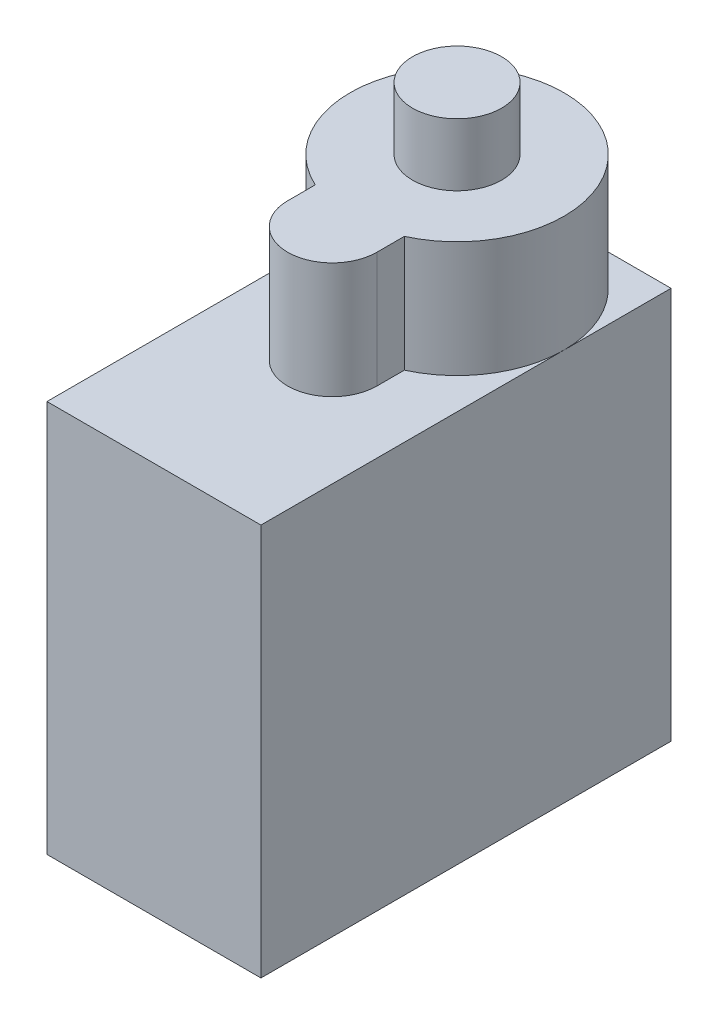
ISO-10303-21;
HEADER;
FILE_DESCRIPTION(('STEP AP214'),'2;1');
FILE_NAME('part.step','',(''),(''),'','','');
FILE_SCHEMA(('AUTOMOTIVE_DESIGN { 1 0 10303 214 1 1 1 1 }'));
ENDSEC;
DATA;
#1=APPLICATION_CONTEXT('core data for automotive mechanical design processes');
#2=APPLICATION_PROTOCOL_DEFINITION('international standard','automotive_design',2000,#1);
#3=PRODUCT_CONTEXT('',#1,'mechanical');
#4=PRODUCT('Part','Part','',(#3));
#5=PRODUCT_RELATED_PRODUCT_CATEGORY('part','',(#4));
#6=PRODUCT_DEFINITION_FORMATION('','',#4);
#7=PRODUCT_DEFINITION_CONTEXT('part definition',#1,'design');
#8=PRODUCT_DEFINITION('design','',#6,#7);
#9=PRODUCT_DEFINITION_SHAPE('','',#8);
#10=(LENGTH_UNIT() NAMED_UNIT(*) SI_UNIT(.MILLI.,.METRE.));
#11=(NAMED_UNIT(*) PLANE_ANGLE_UNIT() SI_UNIT($,.RADIAN.));
#12=(NAMED_UNIT(*) SI_UNIT($,.STERADIAN.) SOLID_ANGLE_UNIT());
#13=UNCERTAINTY_MEASURE_WITH_UNIT(LENGTH_MEASURE(1.E-05),#10,'distance_accuracy_value','');
#14=(GEOMETRIC_REPRESENTATION_CONTEXT(3) GLOBAL_UNCERTAINTY_ASSIGNED_CONTEXT((#13)) GLOBAL_UNIT_ASSIGNED_CONTEXT((#10,
#11,#12)) REPRESENTATION_CONTEXT('',''));
#15=CARTESIAN_POINT('',(0.,0.,0.));
#16=DIRECTION('',(0.,0.,1.));
#17=DIRECTION('',(1.,0.,0.));
#18=AXIS2_PLACEMENT_3D('',#15,#16,#17);
#19=CARTESIAN_POINT('',(51.3143674534142,32.,99.1515964372952));
#20=DIRECTION('',(0.,-1.,0.));
#21=DIRECTION('',(0.,0.,-1.));
#22=AXIS2_PLACEMENT_3D('',#19,#20,#21);
#23=CYLINDRICAL_SURFACE('',#22,2.5);
#24=CARTESIAN_POINT('',(51.3143674534142,28.5,99.1515964372952));
#25=DIRECTION('',(0.,1.,0.));
#26=DIRECTION('',(0.,0.,1.));
#27=AXIS2_PLACEMENT_3D('',#24,#25,#26);
#28=CIRCLE('',#27,2.5);
#29=CARTESIAN_POINT('',(51.3143674534142,28.5,101.651596437295));
#30=VERTEX_POINT('',#29);
#31=EDGE_CURVE('E164',#30,#30,#28,.T.);
#32=ORIENTED_EDGE('',*,*,#31,.T.);
#33=EDGE_LOOP('',(#32));
#34=FACE_BOUND('',#33,.T.);
#35=CARTESIAN_POINT('',(51.3143674534142,32.,99.1515964372952));
#36=DIRECTION('',(0.,1.,0.));
#37=DIRECTION('',(0.,0.,1.));
#38=AXIS2_PLACEMENT_3D('',#35,#36,#37);
#39=CIRCLE('',#38,2.5);
#40=CARTESIAN_POINT('',(51.3143674534142,32.,101.651596437295));
#41=VERTEX_POINT('',#40);
#42=EDGE_CURVE('E39',#41,#41,#39,.T.);
#43=ORIENTED_EDGE('',*,*,#42,.F.);
#44=EDGE_LOOP('',(#43));
#45=FACE_BOUND('',#44,.T.);
#46=ADVANCED_FACE('F32',(#34,#45),#23,.T.);
#47=CARTESIAN_POINT('',(51.3143674534142,32.,99.1515964372952));
#48=DIRECTION('',(0.,1.,0.));
#49=DIRECTION('',(0.,0.,1.));
#50=AXIS2_PLACEMENT_3D('',#47,#48,#49);
#51=PLANE('',#50);
#52=ORIENTED_EDGE('',*,*,#42,.T.);
#53=EDGE_LOOP('',(#52));
#54=FACE_BOUND('',#53,.T.);
#55=ADVANCED_FACE('F228',(#54),#51,.T.);
#56=CARTESIAN_POINT('',(51.3143674534142,28.5,99.1515964372952));
#57=DIRECTION('',(0.,-1.,0.));
#58=DIRECTION('',(0.,0.,-1.));
#59=AXIS2_PLACEMENT_3D('',#56,#57,#58);
#60=CYLINDRICAL_SURFACE('',#59,6.);
#61=CARTESIAN_POINT('',(51.3143674534142,22.,99.1515964372952));
#62=DIRECTION('',(0.,1.,0.));
#63=DIRECTION('',(0.,0.,1.));
#64=AXIS2_PLACEMENT_3D('',#61,#62,#63);
#65=CIRCLE('',#64,6.);
#66=CARTESIAN_POINT('',(57.3143674534142,22.,99.1515964372952));
#67=VERTEX_POINT('',#66);
#68=CARTESIAN_POINT('',(51.3143674534142,22.,93.1515964372952));
#69=VERTEX_POINT('',#68);
#70=EDGE_CURVE('E144',#67,#69,#65,.T.);
#71=ORIENTED_EDGE('',*,*,#70,.T.);
#72=CARTESIAN_POINT('',(45.3143674534142,22.,99.1515964372952));
#73=VERTEX_POINT('',#72);
#74=EDGE_CURVE('E190',#69,#73,#65,.T.);
#75=ORIENTED_EDGE('',*,*,#74,.T.);
#76=CARTESIAN_POINT('',(48.8143674534142,22.,104.605952494613));
#77=VERTEX_POINT('',#76);
#78=EDGE_CURVE('E110',#73,#77,#65,.T.);
#79=ORIENTED_EDGE('',*,*,#78,.T.);
#80=DIRECTION('',(0.,-1.,0.));
#81=VECTOR('',#80,1.);
#82=CARTESIAN_POINT('',(48.8143674534142,28.5,104.605952494613));
#83=LINE('',#82,#81);
#84=CARTESIAN_POINT('',(48.8143674534142,28.5,104.605952494613));
#85=VERTEX_POINT('',#84);
#86=EDGE_CURVE('E161',#85,#77,#83,.T.);
#87=ORIENTED_EDGE('',*,*,#86,.F.);
#88=CARTESIAN_POINT('',(51.3143674534142,28.5,99.1515964372952));
#89=DIRECTION('',(0.,1.,0.));
#90=DIRECTION('',(0.,0.,1.));
#91=AXIS2_PLACEMENT_3D('',#88,#89,#90);
#92=CIRCLE('',#91,6.);
#93=CARTESIAN_POINT('',(53.8143674534142,28.5,104.605952494613));
#94=VERTEX_POINT('',#93);
#95=EDGE_CURVE('E145',#94,#85,#92,.T.);
#96=ORIENTED_EDGE('',*,*,#95,.F.);
#97=DIRECTION('',(0.,-1.,0.));
#98=VECTOR('',#97,1.);
#99=CARTESIAN_POINT('',(53.8143674534142,28.5,104.605952494613));
#100=LINE('',#99,#98);
#101=CARTESIAN_POINT('',(53.8143674534142,22.,104.605952494613));
#102=VERTEX_POINT('',#101);
#103=EDGE_CURVE('E152',#94,#102,#100,.T.);
#104=ORIENTED_EDGE('',*,*,#103,.T.);
#105=EDGE_CURVE('E46',#102,#67,#65,.T.);
#106=ORIENTED_EDGE('',*,*,#105,.T.);
#107=EDGE_LOOP('',(#71,#75,#79,#87,#96,#104,#106));
#108=FACE_BOUND('',#107,.T.);
#109=ADVANCED_FACE('F181',(#108),#60,.T.);
#110=CARTESIAN_POINT('',(48.8143674534142,28.5,106.151596437295));
#111=DIRECTION('',(1.,0.,0.));
#112=DIRECTION('',(0.,0.,-1.));
#113=AXIS2_PLACEMENT_3D('',#110,#111,#112);
#114=PLANE('',#113);
#115=ORIENTED_EDGE('',*,*,#86,.T.);
#116=DIRECTION('',(0.,0.,1.));
#117=VECTOR('',#116,1.);
#118=CARTESIAN_POINT('',(48.8143674534142,22.,106.151596437295));
#119=LINE('',#118,#117);
#120=CARTESIAN_POINT('',(48.8143674534142,22.,106.151596437295));
#121=VERTEX_POINT('',#120);
#122=EDGE_CURVE('E135',#77,#121,#119,.T.);
#123=ORIENTED_EDGE('',*,*,#122,.T.);
#124=DIRECTION('',(0.,-1.,0.));
#125=VECTOR('',#124,1.);
#126=CARTESIAN_POINT('',(48.8143674534142,28.5,106.151596437295));
#127=LINE('',#126,#125);
#128=CARTESIAN_POINT('',(48.8143674534142,28.5,106.151596437295));
#129=VERTEX_POINT('',#128);
#130=EDGE_CURVE('E158',#129,#121,#127,.T.);
#131=ORIENTED_EDGE('',*,*,#130,.F.);
#132=DIRECTION('',(0.,0.,1.));
#133=VECTOR('',#132,1.);
#134=CARTESIAN_POINT('',(48.8143674534142,28.5,106.151596437295));
#135=LINE('',#134,#133);
#136=EDGE_CURVE('E147',#85,#129,#135,.T.);
#137=ORIENTED_EDGE('',*,*,#136,.F.);
#138=EDGE_LOOP('',(#115,#123,#131,#137));
#139=FACE_BOUND('',#138,.T.);
#140=ADVANCED_FACE('F184',(#139),#114,.F.);
#141=CARTESIAN_POINT('',(51.3143674534142,28.5,106.151596437295));
#142=DIRECTION('',(0.,-1.,0.));
#143=DIRECTION('',(0.,0.,-1.));
#144=AXIS2_PLACEMENT_3D('',#141,#142,#143);
#145=CYLINDRICAL_SURFACE('',#144,2.5);
#146=ORIENTED_EDGE('',*,*,#130,.T.);
#147=CARTESIAN_POINT('',(51.3143674534142,22.,106.151596437295));
#148=DIRECTION('',(0.,1.,0.));
#149=DIRECTION('',(0.,0.,1.));
#150=AXIS2_PLACEMENT_3D('',#147,#148,#149);
#151=CIRCLE('',#150,2.5);
#152=CARTESIAN_POINT('',(53.8143674534142,22.,106.151596437295));
#153=VERTEX_POINT('',#152);
#154=EDGE_CURVE('E132',#121,#153,#151,.T.);
#155=ORIENTED_EDGE('',*,*,#154,.T.);
#156=DIRECTION('',(0.,-1.,0.));
#157=VECTOR('',#156,1.);
#158=CARTESIAN_POINT('',(53.8143674534142,28.5,106.151596437295));
#159=LINE('',#158,#157);
#160=CARTESIAN_POINT('',(53.8143674534142,28.5,106.151596437295));
#161=VERTEX_POINT('',#160);
#162=EDGE_CURVE('E155',#161,#153,#159,.T.);
#163=ORIENTED_EDGE('',*,*,#162,.F.);
#164=CARTESIAN_POINT('',(51.3143674534142,28.5,106.151596437295));
#165=DIRECTION('',(0.,1.,0.));
#166=DIRECTION('',(0.,0.,1.));
#167=AXIS2_PLACEMENT_3D('',#164,#165,#166);
#168=CIRCLE('',#167,2.5);
#169=EDGE_CURVE('E149',#129,#161,#168,.T.);
#170=ORIENTED_EDGE('',*,*,#169,.F.);
#171=EDGE_LOOP('',(#146,#155,#163,#170));
#172=FACE_BOUND('',#171,.T.);
#173=ADVANCED_FACE('F188',(#172),#145,.T.);
#174=CARTESIAN_POINT('',(53.8143674534142,28.5,104.605952494613));
#175=DIRECTION('',(-1.,0.,0.));
#176=DIRECTION('',(0.,0.,1.));
#177=AXIS2_PLACEMENT_3D('',#174,#175,#176);
#178=PLANE('',#177);
#179=ORIENTED_EDGE('',*,*,#162,.T.);
#180=DIRECTION('',(0.,0.,-1.));
#181=VECTOR('',#180,1.);
#182=CARTESIAN_POINT('',(53.8143674534142,22.,104.605952494613));
#183=LINE('',#182,#181);
#184=EDGE_CURVE('E11',#153,#102,#183,.T.);
#185=ORIENTED_EDGE('',*,*,#184,.T.);
#186=ORIENTED_EDGE('',*,*,#103,.F.);
#187=DIRECTION('',(0.,0.,-1.));
#188=VECTOR('',#187,1.);
#189=CARTESIAN_POINT('',(53.8143674534142,28.5,104.605952494613));
#190=LINE('',#189,#188);
#191=EDGE_CURVE('E53',#161,#94,#190,.T.);
#192=ORIENTED_EDGE('',*,*,#191,.F.);
#193=EDGE_LOOP('',(#179,#185,#186,#192));
#194=FACE_BOUND('',#193,.T.);
#195=ADVANCED_FACE('F174',(#194),#178,.F.);
#196=CARTESIAN_POINT('',(51.3143674534142,28.5,99.1515964372952));
#197=DIRECTION('',(0.,1.,0.));
#198=DIRECTION('',(0.,0.,1.));
#199=AXIS2_PLACEMENT_3D('',#196,#197,#198);
#200=PLANE('',#199);
#201=ORIENTED_EDGE('',*,*,#31,.F.);
#202=EDGE_LOOP('',(#201));
#203=FACE_BOUND('',#202,.T.);
#204=ORIENTED_EDGE('',*,*,#95,.T.);
#205=ORIENTED_EDGE('',*,*,#136,.T.);
#206=ORIENTED_EDGE('',*,*,#169,.T.);
#207=ORIENTED_EDGE('',*,*,#191,.T.);
#208=EDGE_LOOP('',(#204,#205,#206,#207));
#209=FACE_BOUND('',#208,.T.);
#210=ADVANCED_FACE('F171',(#203,#209),#200,.T.);
#211=CARTESIAN_POINT('',(0.,22.,0.));
#212=DIRECTION('',(0.,1.,0.));
#213=DIRECTION('',(0.,0.,1.));
#214=AXIS2_PLACEMENT_3D('',#211,#212,#213);
#215=PLANE('',#214);
#216=ORIENTED_EDGE('',*,*,#70,.F.);
#217=DIRECTION('',(0.,0.,-1.));
#218=VECTOR('',#217,1.);
#219=CARTESIAN_POINT('',(57.3143674534142,22.,93.1515964372952));
#220=LINE('',#219,#218);
#221=CARTESIAN_POINT('',(57.3143674534142,22.,93.1515964372952));
#222=VERTEX_POINT('',#221);
#223=EDGE_CURVE('E126',#67,#222,#220,.T.);
#224=ORIENTED_EDGE('',*,*,#223,.T.);
#225=DIRECTION('',(-1.,0.,0.));
#226=VECTOR('',#225,1.);
#227=CARTESIAN_POINT('',(45.3143674534142,22.,93.1515964372952));
#228=LINE('',#227,#226);
#229=EDGE_CURVE('E196',#222,#69,#228,.T.);
#230=ORIENTED_EDGE('',*,*,#229,.T.);
#231=EDGE_LOOP('',(#216,#224,#230));
#232=FACE_BOUND('',#231,.T.);
#233=ADVANCED_FACE('F173',(#232),#215,.T.);
#234=ORIENTED_EDGE('',*,*,#74,.F.);
#235=CARTESIAN_POINT('',(45.3143674534142,22.,93.1515964372952));
#236=VERTEX_POINT('',#235);
#237=EDGE_CURVE('E203',#69,#236,#228,.T.);
#238=ORIENTED_EDGE('',*,*,#237,.T.);
#239=DIRECTION('',(0.,0.,1.));
#240=VECTOR('',#239,1.);
#241=CARTESIAN_POINT('',(45.3143674534142,22.,93.1515964372952));
#242=LINE('',#241,#240);
#243=EDGE_CURVE('E115',#236,#73,#242,.T.);
#244=ORIENTED_EDGE('',*,*,#243,.T.);
#245=EDGE_LOOP('',(#234,#238,#244));
#246=FACE_BOUND('',#245,.T.);
#247=ADVANCED_FACE('F219',(#246),#215,.T.);
#248=ORIENTED_EDGE('',*,*,#78,.F.);
#249=CARTESIAN_POINT('',(45.3143674534142,22.,116.151596437295));
#250=VERTEX_POINT('',#249);
#251=EDGE_CURVE('E104',#73,#250,#242,.T.);
#252=ORIENTED_EDGE('',*,*,#251,.T.);
#253=DIRECTION('',(1.,0.,0.));
#254=VECTOR('',#253,1.);
#255=CARTESIAN_POINT('',(45.3143674534142,22.,116.151596437295));
#256=LINE('',#255,#254);
#257=CARTESIAN_POINT('',(57.3143674534142,22.,116.151596437295));
#258=VERTEX_POINT('',#257);
#259=EDGE_CURVE('E107',#250,#258,#256,.T.);
#260=ORIENTED_EDGE('',*,*,#259,.T.);
#261=EDGE_CURVE('E199',#258,#67,#220,.T.);
#262=ORIENTED_EDGE('',*,*,#261,.T.);
#263=ORIENTED_EDGE('',*,*,#105,.F.);
#264=ORIENTED_EDGE('',*,*,#184,.F.);
#265=ORIENTED_EDGE('',*,*,#154,.F.);
#266=ORIENTED_EDGE('',*,*,#122,.F.);
#267=EDGE_LOOP('',(#248,#252,#260,#262,#263,#264,#265,#266));
#268=FACE_BOUND('',#267,.T.);
#269=ADVANCED_FACE('F106',(#268),#215,.T.);
#270=CARTESIAN_POINT('',(45.3143674534142,22.,93.1515964372952));
#271=DIRECTION('',(1.,0.,0.));
#272=DIRECTION('',(0.,0.,-1.));
#273=AXIS2_PLACEMENT_3D('',#270,#271,#272);
#274=PLANE('',#273);
#275=ORIENTED_EDGE('',*,*,#251,.F.);
#276=ORIENTED_EDGE('',*,*,#243,.F.);
#277=DIRECTION('',(0.,-1.,0.));
#278=VECTOR('',#277,1.);
#279=CARTESIAN_POINT('',(45.3143674534142,22.,93.1515964372952));
#280=LINE('',#279,#278);
#281=CARTESIAN_POINT('',(45.3143674534142,0.,93.1515964372952));
#282=VERTEX_POINT('',#281);
#283=EDGE_CURVE('E206',#236,#282,#280,.T.);
#284=ORIENTED_EDGE('',*,*,#283,.T.);
#285=DIRECTION('',(0.,0.,1.));
#286=VECTOR('',#285,1.);
#287=CARTESIAN_POINT('',(45.3143674534142,0.,93.1515964372952));
#288=LINE('',#287,#286);
#289=CARTESIAN_POINT('',(45.3143674534142,0.,116.151596437295));
#290=VERTEX_POINT('',#289);
#291=EDGE_CURVE('E130',#282,#290,#288,.T.);
#292=ORIENTED_EDGE('',*,*,#291,.T.);
#293=DIRECTION('',(0.,-1.,0.));
#294=VECTOR('',#293,1.);
#295=CARTESIAN_POINT('',(45.3143674534142,22.,116.151596437295));
#296=LINE('',#295,#294);
#297=EDGE_CURVE('E122',#250,#290,#296,.T.);
#298=ORIENTED_EDGE('',*,*,#297,.F.);
#299=EDGE_LOOP('',(#275,#276,#284,#292,#298));
#300=FACE_BOUND('',#299,.T.);
#301=ADVANCED_FACE('F128',(#300),#274,.F.);
#302=CARTESIAN_POINT('',(57.3143674534142,22.,93.1515964372952));
#303=DIRECTION('',(-1.,0.,0.));
#304=DIRECTION('',(0.,0.,1.));
#305=AXIS2_PLACEMENT_3D('',#302,#303,#304);
#306=PLANE('',#305);
#307=ORIENTED_EDGE('',*,*,#223,.F.);
#308=ORIENTED_EDGE('',*,*,#261,.F.);
#309=DIRECTION('',(0.,-1.,0.));
#310=VECTOR('',#309,1.);
#311=CARTESIAN_POINT('',(57.3143674534142,22.,116.151596437295));
#312=LINE('',#311,#310);
#313=CARTESIAN_POINT('',(57.3143674534142,0.,116.151596437295));
#314=VERTEX_POINT('',#313);
#315=EDGE_CURVE('E124',#258,#314,#312,.T.);
#316=ORIENTED_EDGE('',*,*,#315,.T.);
#317=DIRECTION('',(0.,0.,-1.));
#318=VECTOR('',#317,1.);
#319=CARTESIAN_POINT('',(57.3143674534142,0.,93.1515964372952));
#320=LINE('',#319,#318);
#321=CARTESIAN_POINT('',(57.3143674534142,0.,93.1515964372952));
#322=VERTEX_POINT('',#321);
#323=EDGE_CURVE('E210',#314,#322,#320,.T.);
#324=ORIENTED_EDGE('',*,*,#323,.T.);
#325=DIRECTION('',(0.,-1.,0.));
#326=VECTOR('',#325,1.);
#327=CARTESIAN_POINT('',(57.3143674534142,22.,93.1515964372952));
#328=LINE('',#327,#326);
#329=EDGE_CURVE('E137',#222,#322,#328,.T.);
#330=ORIENTED_EDGE('',*,*,#329,.F.);
#331=EDGE_LOOP('',(#307,#308,#316,#324,#330));
#332=FACE_BOUND('',#331,.T.);
#333=ADVANCED_FACE('F198',(#332),#306,.F.);
#334=CARTESIAN_POINT('',(45.3143674534142,22.,93.1515964372952));
#335=DIRECTION('',(0.,0.,1.));
#336=DIRECTION('',(1.,0.,0.));
#337=AXIS2_PLACEMENT_3D('',#334,#335,#336);
#338=PLANE('',#337);
#339=ORIENTED_EDGE('',*,*,#237,.F.);
#340=ORIENTED_EDGE('',*,*,#229,.F.);
#341=ORIENTED_EDGE('',*,*,#329,.T.);
#342=DIRECTION('',(-1.,0.,0.));
#343=VECTOR('',#342,1.);
#344=CARTESIAN_POINT('',(45.3143674534142,0.,93.1515964372952));
#345=LINE('',#344,#343);
#346=EDGE_CURVE('E116',#322,#282,#345,.T.);
#347=ORIENTED_EDGE('',*,*,#346,.T.);
#348=ORIENTED_EDGE('',*,*,#283,.F.);
#349=EDGE_LOOP('',(#339,#340,#341,#347,#348));
#350=FACE_BOUND('',#349,.T.);
#351=ADVANCED_FACE('F216',(#350),#338,.F.);
#352=CARTESIAN_POINT('',(45.3143674534142,22.,116.151596437295));
#353=DIRECTION('',(0.,0.,-1.));
#354=DIRECTION('',(-1.,0.,0.));
#355=AXIS2_PLACEMENT_3D('',#352,#353,#354);
#356=PLANE('',#355);
#357=DIRECTION('',(1.,0.,0.));
#358=VECTOR('',#357,1.);
#359=CARTESIAN_POINT('',(45.3143674534142,0.,116.151596437295));
#360=LINE('',#359,#358);
#361=EDGE_CURVE('E208',#290,#314,#360,.T.);
#362=ORIENTED_EDGE('',*,*,#361,.T.);
#363=ORIENTED_EDGE('',*,*,#315,.F.);
#364=ORIENTED_EDGE('',*,*,#259,.F.);
#365=ORIENTED_EDGE('',*,*,#297,.T.);
#366=EDGE_LOOP('',(#362,#363,#364,#365));
#367=FACE_BOUND('',#366,.T.);
#368=ADVANCED_FACE('F121',(#367),#356,.F.);
#369=CARTESIAN_POINT('',(51.3143674534142,0.,99.1515964372952));
#370=DIRECTION('',(0.,1.,0.));
#371=DIRECTION('',(0.,0.,1.));
#372=AXIS2_PLACEMENT_3D('',#369,#370,#371);
#373=PLANE('',#372);
#374=ORIENTED_EDGE('',*,*,#346,.F.);
#375=ORIENTED_EDGE('',*,*,#323,.F.);
#376=ORIENTED_EDGE('',*,*,#361,.F.);
#377=ORIENTED_EDGE('',*,*,#291,.F.);
#378=EDGE_LOOP('',(#374,#375,#376,#377));
#379=FACE_BOUND('',#378,.T.);
#380=ADVANCED_FACE('F239',(#379),#373,.F.);
#381=CLOSED_SHELL('',(#46,#55,#109,#140,#173,#195,#210,#233,#247,#269,#301,#333,#351,#368,#380));
#382=MANIFOLD_SOLID_BREP('B2',#381);
#383=ADVANCED_BREP_SHAPE_REPRESENTATION('',(#18,#382),#14);
#384=SHAPE_DEFINITION_REPRESENTATION(#9,#383);
ENDSEC;
END-ISO-10303-21;
